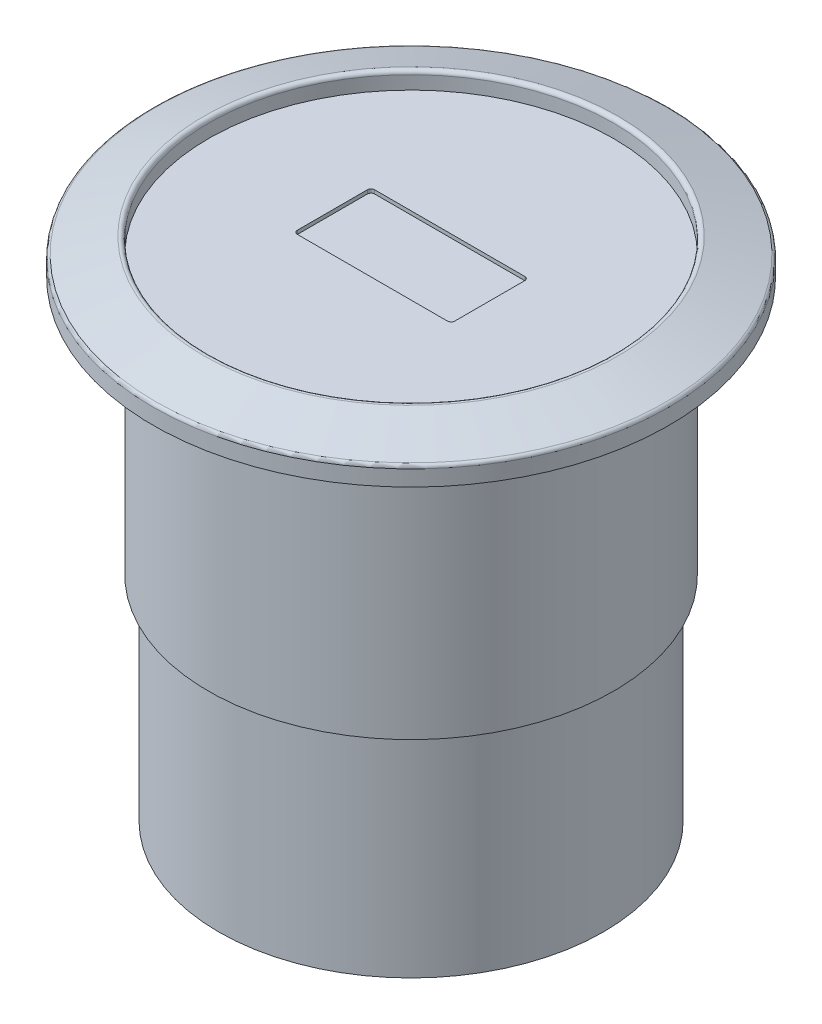
ISO-10303-21;
HEADER;
FILE_DESCRIPTION(('STEP AP214'),'2;1');
FILE_NAME('part.step','',(''),(''),'','','');
FILE_SCHEMA(('AUTOMOTIVE_DESIGN { 1 0 10303 214 1 1 1 1 }'));
ENDSEC;
DATA;
#1=APPLICATION_CONTEXT('core data for automotive mechanical design processes');
#2=APPLICATION_PROTOCOL_DEFINITION('international standard','automotive_design',2000,#1);
#3=PRODUCT_CONTEXT('',#1,'mechanical');
#4=PRODUCT('Part','Part','',(#3));
#5=PRODUCT_RELATED_PRODUCT_CATEGORY('part','',(#4));
#6=PRODUCT_DEFINITION_FORMATION('','',#4);
#7=PRODUCT_DEFINITION_CONTEXT('part definition',#1,'design');
#8=PRODUCT_DEFINITION('design','',#6,#7);
#9=PRODUCT_DEFINITION_SHAPE('','',#8);
#10=(LENGTH_UNIT() NAMED_UNIT(*) SI_UNIT(.MILLI.,.METRE.));
#11=(NAMED_UNIT(*) PLANE_ANGLE_UNIT() SI_UNIT($,.RADIAN.));
#12=(NAMED_UNIT(*) SI_UNIT($,.STERADIAN.) SOLID_ANGLE_UNIT());
#13=UNCERTAINTY_MEASURE_WITH_UNIT(LENGTH_MEASURE(1.E-05),#10,'distance_accuracy_value','');
#14=(GEOMETRIC_REPRESENTATION_CONTEXT(3) GLOBAL_UNCERTAINTY_ASSIGNED_CONTEXT((#13)) GLOBAL_UNIT_ASSIGNED_CONTEXT((#10,
#11,#12)) REPRESENTATION_CONTEXT('',''));
#15=CARTESIAN_POINT('',(0.,0.,0.));
#16=DIRECTION('',(0.,0.,1.));
#17=DIRECTION('',(1.,0.,0.));
#18=AXIS2_PLACEMENT_3D('',#15,#16,#17);
#19=CARTESIAN_POINT('',(0.,26.6,0.));
#20=DIRECTION('',(0.,-1.,0.));
#21=DIRECTION('',(0.,0.,-1.));
#22=AXIS2_PLACEMENT_3D('',#19,#20,#21);
#23=PLANE('',#22);
#24=DIRECTION('',(0.,0.,-1.));
#25=VECTOR('',#24,1.);
#26=CARTESIAN_POINT('',(4.275,26.6,2.1));
#27=LINE('',#26,#25);
#28=CARTESIAN_POINT('',(4.275,26.6,1.9));
#29=VERTEX_POINT('',#28);
#30=CARTESIAN_POINT('',(4.275,26.6,-1.9));
#31=VERTEX_POINT('',#30);
#32=EDGE_CURVE('E109',#29,#31,#27,.T.);
#33=ORIENTED_EDGE('',*,*,#32,.F.);
#34=CARTESIAN_POINT('',(4.075,26.6,1.9));
#35=DIRECTION('',(0.,-1.,0.));
#36=DIRECTION('',(0.,0.,-1.));
#37=AXIS2_PLACEMENT_3D('',#34,#35,#36);
#38=CIRCLE('',#37,0.2);
#39=CARTESIAN_POINT('',(4.075,26.6,2.1));
#40=VERTEX_POINT('',#39);
#41=EDGE_CURVE('E144',#29,#40,#38,.T.);
#42=ORIENTED_EDGE('',*,*,#41,.T.);
#43=DIRECTION('',(1.,0.,0.));
#44=VECTOR('',#43,1.);
#45=CARTESIAN_POINT('',(-4.275,26.6,2.1));
#46=LINE('',#45,#44);
#47=CARTESIAN_POINT('',(-4.075,26.6,2.1));
#48=VERTEX_POINT('',#47);
#49=EDGE_CURVE('E146',#48,#40,#46,.T.);
#50=ORIENTED_EDGE('',*,*,#49,.F.);
#51=CARTESIAN_POINT('',(-4.075,26.6,1.9));
#52=DIRECTION('',(0.,-1.,0.));
#53=DIRECTION('',(0.,0.,-1.));
#54=AXIS2_PLACEMENT_3D('',#51,#52,#53);
#55=CIRCLE('',#54,0.2);
#56=CARTESIAN_POINT('',(-4.275,26.6,1.9));
#57=VERTEX_POINT('',#56);
#58=EDGE_CURVE('E42',#48,#57,#55,.T.);
#59=ORIENTED_EDGE('',*,*,#58,.T.);
#60=DIRECTION('',(0.,0.,-1.));
#61=VECTOR('',#60,1.);
#62=CARTESIAN_POINT('',(-4.275,26.6,2.1));
#63=LINE('',#62,#61);
#64=CARTESIAN_POINT('',(-4.275,26.6,-1.9));
#65=VERTEX_POINT('',#64);
#66=EDGE_CURVE('E100',#57,#65,#63,.T.);
#67=ORIENTED_EDGE('',*,*,#66,.T.);
#68=CARTESIAN_POINT('',(-4.075,26.6,-1.9));
#69=DIRECTION('',(0.,-1.,0.));
#70=DIRECTION('',(0.,0.,-1.));
#71=AXIS2_PLACEMENT_3D('',#68,#69,#70);
#72=CIRCLE('',#71,0.2);
#73=CARTESIAN_POINT('',(-4.075,26.6,-2.1));
#74=VERTEX_POINT('',#73);
#75=EDGE_CURVE('E11',#65,#74,#72,.T.);
#76=ORIENTED_EDGE('',*,*,#75,.T.);
#77=DIRECTION('',(1.,0.,0.));
#78=VECTOR('',#77,1.);
#79=CARTESIAN_POINT('',(-4.275,26.6,-2.1));
#80=LINE('',#79,#78);
#81=CARTESIAN_POINT('',(4.075,26.6,-2.1));
#82=VERTEX_POINT('',#81);
#83=EDGE_CURVE('E99',#74,#82,#80,.T.);
#84=ORIENTED_EDGE('',*,*,#83,.T.);
#85=CARTESIAN_POINT('',(4.075,26.6,-1.9));
#86=DIRECTION('',(0.,-1.,0.));
#87=DIRECTION('',(0.,0.,-1.));
#88=AXIS2_PLACEMENT_3D('',#85,#86,#87);
#89=CIRCLE('',#88,0.2);
#90=EDGE_CURVE('E142',#82,#31,#89,.T.);
#91=ORIENTED_EDGE('',*,*,#90,.T.);
#92=EDGE_LOOP('',(#33,#42,#50,#59,#67,#76,#84,#91));
#93=FACE_BOUND('',#92,.T.);
#94=CARTESIAN_POINT('',(0.,26.6,0.));
#95=DIRECTION('',(0.,-1.,0.));
#96=DIRECTION('',(0.,0.,-1.));
#97=AXIS2_PLACEMENT_3D('',#94,#95,#96);
#98=CIRCLE('',#97,11.);
#99=CARTESIAN_POINT('',(0.,26.6,-11.));
#100=VERTEX_POINT('',#99);
#101=EDGE_CURVE('E194',#100,#100,#98,.T.);
#102=ORIENTED_EDGE('',*,*,#101,.F.);
#103=EDGE_LOOP('',(#102));
#104=FACE_BOUND('',#103,.T.);
#105=ADVANCED_FACE('F34',(#93,#104),#23,.F.);
#106=CARTESIAN_POINT('',(0.,0.,0.));
#107=DIRECTION('',(0.,-1.,0.));
#108=DIRECTION('',(0.,0.,-1.));
#109=AXIS2_PLACEMENT_3D('',#106,#107,#108);
#110=CYLINDRICAL_SURFACE('',#109,11.);
#111=CARTESIAN_POINT('',(0.,27.3225148226554,0.));
#112=DIRECTION('',(0.,1.,0.));
#113=DIRECTION('',(0.,0.,1.));
#114=AXIS2_PLACEMENT_3D('',#111,#112,#113);
#115=CIRCLE('',#114,11.);
#116=CARTESIAN_POINT('',(0.,27.3225148226554,11.));
#117=VERTEX_POINT('',#116);
#118=EDGE_CURVE('E113',#117,#117,#115,.T.);
#119=ORIENTED_EDGE('',*,*,#118,.T.);
#120=EDGE_LOOP('',(#119));
#121=FACE_BOUND('',#120,.T.);
#122=ORIENTED_EDGE('',*,*,#101,.T.);
#123=EDGE_LOOP('',(#122));
#124=FACE_BOUND('',#123,.T.);
#125=ADVANCED_FACE('F235',(#121,#124),#110,.F.);
#126=CARTESIAN_POINT('',(0.,27.6,0.));
#127=DIRECTION('',(0.,-1.,0.));
#128=DIRECTION('',(0.,0.,-1.));
#129=AXIS2_PLACEMENT_3D('',#126,#127,#128);
#130=CONICAL_SURFACE('',#129,11.,1.24904577239826);
#131=CARTESIAN_POINT('',(0.,26.6455848155989,0.));
#132=DIRECTION('',(0.,1.,0.));
#133=DIRECTION('',(0.,0.,1.));
#134=AXIS2_PLACEMENT_3D('',#131,#132,#133);
#135=CIRCLE('',#134,13.8632455532034);
#136=CARTESIAN_POINT('',(0.,26.6455848155989,13.8632455532034));
#137=VERTEX_POINT('',#136);
#138=EDGE_CURVE('E118',#137,#137,#135,.T.);
#139=ORIENTED_EDGE('',*,*,#138,.T.);
#140=EDGE_LOOP('',(#139));
#141=FACE_BOUND('',#140,.T.);
#142=CARTESIAN_POINT('',(0.,27.5122514822655,0.));
#143=DIRECTION('',(0.,1.,0.));
#144=DIRECTION('',(0.,0.,1.));
#145=AXIS2_PLACEMENT_3D('',#142,#143,#144);
#146=CIRCLE('',#145,11.2632455532034);
#147=CARTESIAN_POINT('',(0.,27.5122514822655,11.2632455532034));
#148=VERTEX_POINT('',#147);
#149=EDGE_CURVE('E200',#148,#148,#146,.F.);
#150=ORIENTED_EDGE('',*,*,#149,.T.);
#151=EDGE_LOOP('',(#150));
#152=FACE_BOUND('',#151,.T.);
#153=ADVANCED_FACE('F205',(#141,#152),#130,.T.);
#154=CARTESIAN_POINT('',(0.,0.,0.));
#155=DIRECTION('',(0.,-1.,0.));
#156=DIRECTION('',(0.,0.,-1.));
#157=AXIS2_PLACEMENT_3D('',#154,#155,#156);
#158=CYLINDRICAL_SURFACE('',#157,14.);
#159=CARTESIAN_POINT('',(0.,26.4558481559888,0.));
#160=DIRECTION('',(0.,1.,0.));
#161=DIRECTION('',(0.,0.,1.));
#162=AXIS2_PLACEMENT_3D('',#159,#160,#161);
#163=CIRCLE('',#162,14.);
#164=CARTESIAN_POINT('',(0.,26.4558481559888,14.));
#165=VERTEX_POINT('',#164);
#166=EDGE_CURVE('E197',#165,#165,#163,.F.);
#167=ORIENTED_EDGE('',*,*,#166,.T.);
#168=EDGE_LOOP('',(#167));
#169=FACE_BOUND('',#168,.T.);
#170=CARTESIAN_POINT('',(0.,25.6,0.));
#171=DIRECTION('',(0.,-1.,0.));
#172=DIRECTION('',(0.,0.,-1.));
#173=AXIS2_PLACEMENT_3D('',#170,#171,#172);
#174=CIRCLE('',#173,14.);
#175=CARTESIAN_POINT('',(0.,25.6,-14.));
#176=VERTEX_POINT('',#175);
#177=EDGE_CURVE('E191',#176,#176,#174,.T.);
#178=ORIENTED_EDGE('',*,*,#177,.F.);
#179=EDGE_LOOP('',(#178));
#180=FACE_BOUND('',#179,.T.);
#181=ADVANCED_FACE('F216',(#169,#180),#158,.T.);
#182=CARTESIAN_POINT('',(-14.,25.6,0.));
#183=DIRECTION('',(0.,1.,0.));
#184=DIRECTION('',(0.,0.,1.));
#185=AXIS2_PLACEMENT_3D('',#182,#183,#184);
#186=PLANE('',#185);
#187=CARTESIAN_POINT('',(0.,25.6,0.));
#188=DIRECTION('',(0.,-1.,0.));
#189=DIRECTION('',(0.,0.,-1.));
#190=AXIS2_PLACEMENT_3D('',#187,#188,#189);
#191=CIRCLE('',#190,11.);
#192=CARTESIAN_POINT('',(0.,25.6,-11.));
#193=VERTEX_POINT('',#192);
#194=EDGE_CURVE('E188',#193,#193,#191,.T.);
#195=ORIENTED_EDGE('',*,*,#194,.F.);
#196=EDGE_LOOP('',(#195));
#197=FACE_BOUND('',#196,.T.);
#198=ORIENTED_EDGE('',*,*,#177,.T.);
#199=EDGE_LOOP('',(#198));
#200=FACE_BOUND('',#199,.T.);
#201=ADVANCED_FACE('F219',(#197,#200),#186,.F.);
#202=CARTESIAN_POINT('',(0.,0.,0.));
#203=DIRECTION('',(0.,-1.,0.));
#204=DIRECTION('',(0.,0.,-1.));
#205=AXIS2_PLACEMENT_3D('',#202,#203,#204);
#206=CYLINDRICAL_SURFACE('',#205,11.);
#207=CARTESIAN_POINT('',(0.,11.6,0.));
#208=DIRECTION('',(0.,-1.,0.));
#209=DIRECTION('',(0.,0.,-1.));
#210=AXIS2_PLACEMENT_3D('',#207,#208,#209);
#211=CIRCLE('',#210,11.);
#212=CARTESIAN_POINT('',(0.,11.6,-11.));
#213=VERTEX_POINT('',#212);
#214=EDGE_CURVE('E185',#213,#213,#211,.T.);
#215=ORIENTED_EDGE('',*,*,#214,.F.);
#216=EDGE_LOOP('',(#215));
#217=FACE_BOUND('',#216,.T.);
#218=ORIENTED_EDGE('',*,*,#194,.T.);
#219=EDGE_LOOP('',(#218));
#220=FACE_BOUND('',#219,.T.);
#221=ADVANCED_FACE('F224',(#217,#220),#206,.T.);
#222=CARTESIAN_POINT('',(-11.,11.6,0.));
#223=DIRECTION('',(0.,1.,0.));
#224=DIRECTION('',(0.,0.,1.));
#225=AXIS2_PLACEMENT_3D('',#222,#223,#224);
#226=PLANE('',#225);
#227=CARTESIAN_POINT('',(0.,11.6,0.));
#228=DIRECTION('',(0.,-1.,0.));
#229=DIRECTION('',(0.,0.,-1.));
#230=AXIS2_PLACEMENT_3D('',#227,#228,#229);
#231=CIRCLE('',#230,10.45);
#232=CARTESIAN_POINT('',(0.,11.6,-10.45));
#233=VERTEX_POINT('',#232);
#234=EDGE_CURVE('E182',#233,#233,#231,.T.);
#235=ORIENTED_EDGE('',*,*,#234,.F.);
#236=EDGE_LOOP('',(#235));
#237=FACE_BOUND('',#236,.T.);
#238=ORIENTED_EDGE('',*,*,#214,.T.);
#239=EDGE_LOOP('',(#238));
#240=FACE_BOUND('',#239,.T.);
#241=ADVANCED_FACE('F230',(#237,#240),#226,.F.);
#242=CARTESIAN_POINT('',(0.,0.,0.));
#243=DIRECTION('',(0.,-1.,0.));
#244=DIRECTION('',(0.,0.,-1.));
#245=AXIS2_PLACEMENT_3D('',#242,#243,#244);
#246=CYLINDRICAL_SURFACE('',#245,10.45);
#247=CARTESIAN_POINT('',(0.,0.,0.));
#248=DIRECTION('',(0.,-1.,0.));
#249=DIRECTION('',(0.,0.,-1.));
#250=AXIS2_PLACEMENT_3D('',#247,#248,#249);
#251=CIRCLE('',#250,10.45);
#252=CARTESIAN_POINT('',(0.,0.,-10.45));
#253=VERTEX_POINT('',#252);
#254=EDGE_CURVE('E176',#253,#253,#251,.T.);
#255=ORIENTED_EDGE('',*,*,#254,.F.);
#256=EDGE_LOOP('',(#255));
#257=FACE_BOUND('',#256,.T.);
#258=ORIENTED_EDGE('',*,*,#234,.T.);
#259=EDGE_LOOP('',(#258));
#260=FACE_BOUND('',#259,.T.);
#261=ADVANCED_FACE('F277',(#257,#260),#246,.T.);
#262=CARTESIAN_POINT('',(-10.45,0.,0.));
#263=DIRECTION('',(0.,1.,0.));
#264=DIRECTION('',(0.,0.,1.));
#265=AXIS2_PLACEMENT_3D('',#262,#263,#264);
#266=PLANE('',#265);
#267=ORIENTED_EDGE('',*,*,#254,.T.);
#268=EDGE_LOOP('',(#267));
#269=FACE_BOUND('',#268,.T.);
#270=ADVANCED_FACE('F212',(#269),#266,.F.);
#271=CARTESIAN_POINT('',(0.,26.4558481559888,0.));
#272=DIRECTION('',(0.,1.,0.));
#273=DIRECTION('',(0.,0.,1.));
#274=AXIS2_PLACEMENT_3D('',#271,#272,#273);
#275=TOROIDAL_SURFACE('',#274,13.8,0.2);
#276=ORIENTED_EDGE('',*,*,#138,.F.);
#277=EDGE_LOOP('',(#276));
#278=FACE_BOUND('',#277,.T.);
#279=ORIENTED_EDGE('',*,*,#166,.F.);
#280=EDGE_LOOP('',(#279));
#281=FACE_BOUND('',#280,.T.);
#282=ADVANCED_FACE('F208',(#278,#281),#275,.T.);
#283=CARTESIAN_POINT('',(0.,27.3225148226554,0.));
#284=DIRECTION('',(0.,1.,0.));
#285=DIRECTION('',(0.,0.,1.));
#286=AXIS2_PLACEMENT_3D('',#283,#284,#285);
#287=TOROIDAL_SURFACE('',#286,11.2,0.2);
#288=ORIENTED_EDGE('',*,*,#118,.F.);
#289=EDGE_LOOP('',(#288));
#290=FACE_BOUND('',#289,.T.);
#291=ORIENTED_EDGE('',*,*,#149,.F.);
#292=EDGE_LOOP('',(#291));
#293=FACE_BOUND('',#292,.T.);
#294=ADVANCED_FACE('F211',(#290,#293),#287,.T.);
#295=CARTESIAN_POINT('',(-4.275,26.4,2.1));
#296=DIRECTION('',(0.,0.,1.));
#297=DIRECTION('',(1.,0.,0.));
#298=AXIS2_PLACEMENT_3D('',#295,#296,#297);
#299=PLANE('',#298);
#300=ORIENTED_EDGE('',*,*,#49,.T.);
#301=DIRECTION('',(0.,1.,0.));
#302=VECTOR('',#301,1.);
#303=CARTESIAN_POINT('',(4.075,26.4,2.1));
#304=LINE('',#303,#302);
#305=CARTESIAN_POINT('',(4.075,26.4,2.1));
#306=VERTEX_POINT('',#305);
#307=EDGE_CURVE('E136',#40,#306,#304,.F.);
#308=ORIENTED_EDGE('',*,*,#307,.T.);
#309=DIRECTION('',(1.,0.,0.));
#310=VECTOR('',#309,1.);
#311=CARTESIAN_POINT('',(-4.275,26.4,2.1));
#312=LINE('',#311,#310);
#313=CARTESIAN_POINT('',(-4.075,26.4,2.1));
#314=VERTEX_POINT('',#313);
#315=EDGE_CURVE('E165',#314,#306,#312,.T.);
#316=ORIENTED_EDGE('',*,*,#315,.F.);
#317=DIRECTION('',(0.,1.,0.));
#318=VECTOR('',#317,1.);
#319=CARTESIAN_POINT('',(-4.075,26.4,2.1));
#320=LINE('',#319,#318);
#321=EDGE_CURVE('E133',#314,#48,#320,.T.);
#322=ORIENTED_EDGE('',*,*,#321,.T.);
#323=EDGE_LOOP('',(#300,#308,#316,#322));
#324=FACE_BOUND('',#323,.T.);
#325=ADVANCED_FACE('F152',(#324),#299,.F.);
#326=CARTESIAN_POINT('',(-4.275,26.4,2.1));
#327=DIRECTION('',(1.,0.,0.));
#328=DIRECTION('',(0.,0.,-1.));
#329=AXIS2_PLACEMENT_3D('',#326,#327,#328);
#330=PLANE('',#329);
#331=ORIENTED_EDGE('',*,*,#66,.F.);
#332=DIRECTION('',(0.,1.,0.));
#333=VECTOR('',#332,1.);
#334=CARTESIAN_POINT('',(-4.275,26.4,1.9));
#335=LINE('',#334,#333);
#336=CARTESIAN_POINT('',(-4.275,26.4,1.9));
#337=VERTEX_POINT('',#336);
#338=EDGE_CURVE('E140',#57,#337,#335,.F.);
#339=ORIENTED_EDGE('',*,*,#338,.T.);
#340=DIRECTION('',(0.,0.,-1.));
#341=VECTOR('',#340,1.);
#342=CARTESIAN_POINT('',(-4.275,26.4,2.1));
#343=LINE('',#342,#341);
#344=CARTESIAN_POINT('',(-4.275,26.4,-1.9));
#345=VERTEX_POINT('',#344);
#346=EDGE_CURVE('E171',#337,#345,#343,.T.);
#347=ORIENTED_EDGE('',*,*,#346,.T.);
#348=DIRECTION('',(0.,1.,0.));
#349=VECTOR('',#348,1.);
#350=CARTESIAN_POINT('',(-4.275,26.6,-1.9));
#351=LINE('',#350,#349);
#352=EDGE_CURVE('E138',#345,#65,#351,.T.);
#353=ORIENTED_EDGE('',*,*,#352,.T.);
#354=EDGE_LOOP('',(#331,#339,#347,#353));
#355=FACE_BOUND('',#354,.T.);
#356=ADVANCED_FACE('F262',(#355),#330,.T.);
#357=CARTESIAN_POINT('',(-4.275,26.4,-2.1));
#358=DIRECTION('',(0.,0.,1.));
#359=DIRECTION('',(1.,0.,0.));
#360=AXIS2_PLACEMENT_3D('',#357,#358,#359);
#361=PLANE('',#360);
#362=DIRECTION('',(1.,0.,0.));
#363=VECTOR('',#362,1.);
#364=CARTESIAN_POINT('',(-4.275,26.4,-2.1));
#365=LINE('',#364,#363);
#366=CARTESIAN_POINT('',(-4.075,26.4,-2.1));
#367=VERTEX_POINT('',#366);
#368=CARTESIAN_POINT('',(4.075,26.4,-2.1));
#369=VERTEX_POINT('',#368);
#370=EDGE_CURVE('E169',#367,#369,#365,.T.);
#371=ORIENTED_EDGE('',*,*,#370,.T.);
#372=DIRECTION('',(0.,1.,0.));
#373=VECTOR('',#372,1.);
#374=CARTESIAN_POINT('',(4.075,26.4,-2.1));
#375=LINE('',#374,#373);
#376=EDGE_CURVE('E108',#369,#82,#375,.T.);
#377=ORIENTED_EDGE('',*,*,#376,.T.);
#378=ORIENTED_EDGE('',*,*,#83,.F.);
#379=DIRECTION('',(0.,1.,0.));
#380=VECTOR('',#379,1.);
#381=CARTESIAN_POINT('',(-4.075,26.4,-2.1));
#382=LINE('',#381,#380);
#383=EDGE_CURVE('E105',#74,#367,#382,.F.);
#384=ORIENTED_EDGE('',*,*,#383,.T.);
#385=EDGE_LOOP('',(#371,#377,#378,#384));
#386=FACE_BOUND('',#385,.T.);
#387=ADVANCED_FACE('F104',(#386),#361,.T.);
#388=CARTESIAN_POINT('',(4.275,26.4,2.1));
#389=DIRECTION('',(1.,0.,0.));
#390=DIRECTION('',(0.,0.,-1.));
#391=AXIS2_PLACEMENT_3D('',#388,#389,#390);
#392=PLANE('',#391);
#393=ORIENTED_EDGE('',*,*,#32,.T.);
#394=DIRECTION('',(0.,1.,0.));
#395=VECTOR('',#394,1.);
#396=CARTESIAN_POINT('',(4.275,26.4,-1.9));
#397=LINE('',#396,#395);
#398=CARTESIAN_POINT('',(4.275,26.4,-1.9));
#399=VERTEX_POINT('',#398);
#400=EDGE_CURVE('E124',#31,#399,#397,.F.);
#401=ORIENTED_EDGE('',*,*,#400,.T.);
#402=DIRECTION('',(0.,0.,-1.));
#403=VECTOR('',#402,1.);
#404=CARTESIAN_POINT('',(4.275,26.4,2.1));
#405=LINE('',#404,#403);
#406=CARTESIAN_POINT('',(4.275,26.4,1.9));
#407=VERTEX_POINT('',#406);
#408=EDGE_CURVE('E163',#407,#399,#405,.T.);
#409=ORIENTED_EDGE('',*,*,#408,.F.);
#410=DIRECTION('',(0.,1.,0.));
#411=VECTOR('',#410,1.);
#412=CARTESIAN_POINT('',(4.275,26.6,1.9));
#413=LINE('',#412,#411);
#414=EDGE_CURVE('E115',#407,#29,#413,.T.);
#415=ORIENTED_EDGE('',*,*,#414,.T.);
#416=EDGE_LOOP('',(#393,#401,#409,#415));
#417=FACE_BOUND('',#416,.T.);
#418=ADVANCED_FACE('F167',(#417),#392,.F.);
#419=CARTESIAN_POINT('',(0.,26.4,0.));
#420=DIRECTION('',(0.,1.,0.));
#421=DIRECTION('',(0.,0.,1.));
#422=AXIS2_PLACEMENT_3D('',#419,#420,#421);
#423=PLANE('',#422);
#424=ORIENTED_EDGE('',*,*,#408,.T.);
#425=CARTESIAN_POINT('',(4.075,26.4,-1.9));
#426=DIRECTION('',(0.,1.,0.));
#427=DIRECTION('',(0.,0.,1.));
#428=AXIS2_PLACEMENT_3D('',#425,#426,#427);
#429=CIRCLE('',#428,0.2);
#430=EDGE_CURVE('E131',#399,#369,#429,.T.);
#431=ORIENTED_EDGE('',*,*,#430,.T.);
#432=ORIENTED_EDGE('',*,*,#370,.F.);
#433=CARTESIAN_POINT('',(-4.075,26.4,-1.9));
#434=DIRECTION('',(0.,1.,0.));
#435=DIRECTION('',(0.,0.,1.));
#436=AXIS2_PLACEMENT_3D('',#433,#434,#435);
#437=CIRCLE('',#436,0.2);
#438=EDGE_CURVE('E112',#367,#345,#437,.T.);
#439=ORIENTED_EDGE('',*,*,#438,.T.);
#440=ORIENTED_EDGE('',*,*,#346,.F.);
#441=CARTESIAN_POINT('',(-4.075,26.4,1.9));
#442=DIRECTION('',(0.,1.,0.));
#443=DIRECTION('',(0.,0.,1.));
#444=AXIS2_PLACEMENT_3D('',#441,#442,#443);
#445=CIRCLE('',#444,0.2);
#446=EDGE_CURVE('E127',#337,#314,#445,.T.);
#447=ORIENTED_EDGE('',*,*,#446,.T.);
#448=ORIENTED_EDGE('',*,*,#315,.T.);
#449=CARTESIAN_POINT('',(4.075,26.4,1.9));
#450=DIRECTION('',(0.,1.,0.));
#451=DIRECTION('',(0.,0.,1.));
#452=AXIS2_PLACEMENT_3D('',#449,#450,#451);
#453=CIRCLE('',#452,0.2);
#454=EDGE_CURVE('E129',#306,#407,#453,.T.);
#455=ORIENTED_EDGE('',*,*,#454,.T.);
#456=EDGE_LOOP('',(#424,#431,#432,#439,#440,#447,#448,#455));
#457=FACE_BOUND('',#456,.T.);
#458=ADVANCED_FACE('F162',(#457),#423,.T.);
#459=CARTESIAN_POINT('',(4.075,26.4,-1.9));
#460=DIRECTION('',(0.,1.,0.));
#461=DIRECTION('',(0.,0.,1.));
#462=AXIS2_PLACEMENT_3D('',#459,#460,#461);
#463=CYLINDRICAL_SURFACE('',#462,0.2);
#464=ORIENTED_EDGE('',*,*,#430,.F.);
#465=ORIENTED_EDGE('',*,*,#400,.F.);
#466=ORIENTED_EDGE('',*,*,#90,.F.);
#467=ORIENTED_EDGE('',*,*,#376,.F.);
#468=EDGE_LOOP('',(#464,#465,#466,#467));
#469=FACE_BOUND('',#468,.T.);
#470=ADVANCED_FACE('F247',(#469),#463,.F.);
#471=CARTESIAN_POINT('',(4.075,26.4,1.9));
#472=DIRECTION('',(0.,-1.,0.));
#473=DIRECTION('',(0.,0.,-1.));
#474=AXIS2_PLACEMENT_3D('',#471,#472,#473);
#475=CYLINDRICAL_SURFACE('',#474,0.2);
#476=ORIENTED_EDGE('',*,*,#454,.F.);
#477=ORIENTED_EDGE('',*,*,#307,.F.);
#478=ORIENTED_EDGE('',*,*,#41,.F.);
#479=ORIENTED_EDGE('',*,*,#414,.F.);
#480=EDGE_LOOP('',(#476,#477,#478,#479));
#481=FACE_BOUND('',#480,.T.);
#482=ADVANCED_FACE('F158',(#481),#475,.F.);
#483=CARTESIAN_POINT('',(-4.075,26.4,1.9));
#484=DIRECTION('',(0.,1.,0.));
#485=DIRECTION('',(0.,0.,1.));
#486=AXIS2_PLACEMENT_3D('',#483,#484,#485);
#487=CYLINDRICAL_SURFACE('',#486,0.2);
#488=ORIENTED_EDGE('',*,*,#446,.F.);
#489=ORIENTED_EDGE('',*,*,#338,.F.);
#490=ORIENTED_EDGE('',*,*,#58,.F.);
#491=ORIENTED_EDGE('',*,*,#321,.F.);
#492=EDGE_LOOP('',(#488,#489,#490,#491));
#493=FACE_BOUND('',#492,.T.);
#494=ADVANCED_FACE('F252',(#493),#487,.F.);
#495=CARTESIAN_POINT('',(-4.075,26.4,-1.9));
#496=DIRECTION('',(0.,-1.,0.));
#497=DIRECTION('',(0.,0.,-1.));
#498=AXIS2_PLACEMENT_3D('',#495,#496,#497);
#499=CYLINDRICAL_SURFACE('',#498,0.2);
#500=ORIENTED_EDGE('',*,*,#438,.F.);
#501=ORIENTED_EDGE('',*,*,#383,.F.);
#502=ORIENTED_EDGE('',*,*,#75,.F.);
#503=ORIENTED_EDGE('',*,*,#352,.F.);
#504=EDGE_LOOP('',(#500,#501,#502,#503));
#505=FACE_BOUND('',#504,.T.);
#506=ADVANCED_FACE('F36',(#505),#499,.F.);
#507=CLOSED_SHELL('',(#105,#125,#153,#181,#201,#221,#241,#261,#270,#282,#294,#325,#356,#387,
#418,#458,#470,#482,#494,#506));
#508=MANIFOLD_SOLID_BREP('B2',#507);
#509=ADVANCED_BREP_SHAPE_REPRESENTATION('',(#18,#508),#14);
#510=SHAPE_DEFINITION_REPRESENTATION(#9,#509);
ENDSEC;
END-ISO-10303-21;
